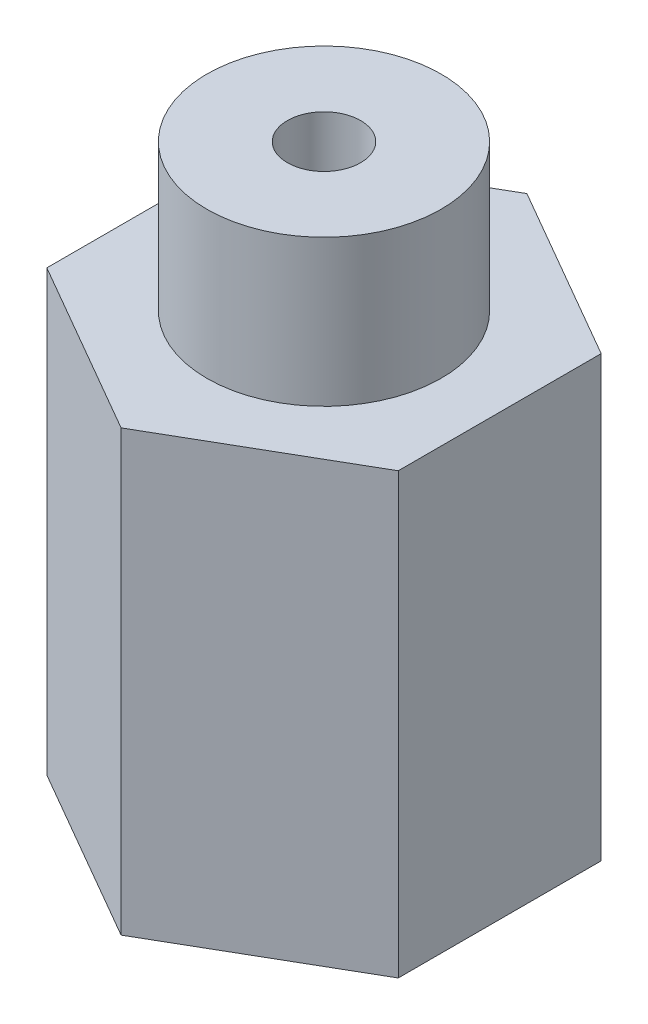
ISO-10303-21;
HEADER;
FILE_DESCRIPTION(('STEP AP214'),'2;1');
FILE_NAME('part.step','',(''),(''),'','','');
FILE_SCHEMA(('AUTOMOTIVE_DESIGN { 1 0 10303 214 1 1 1 1 }'));
ENDSEC;
DATA;
#1=APPLICATION_CONTEXT('core data for automotive mechanical design processes');
#2=APPLICATION_PROTOCOL_DEFINITION('international standard','automotive_design',2000,#1);
#3=PRODUCT_CONTEXT('',#1,'mechanical');
#4=PRODUCT('Part','Part','',(#3));
#5=PRODUCT_RELATED_PRODUCT_CATEGORY('part','',(#4));
#6=PRODUCT_DEFINITION_FORMATION('','',#4);
#7=PRODUCT_DEFINITION_CONTEXT('part definition',#1,'design');
#8=PRODUCT_DEFINITION('design','',#6,#7);
#9=PRODUCT_DEFINITION_SHAPE('','',#8);
#10=(LENGTH_UNIT() NAMED_UNIT(*) SI_UNIT(.MILLI.,.METRE.));
#11=(NAMED_UNIT(*) PLANE_ANGLE_UNIT() SI_UNIT($,.RADIAN.));
#12=(NAMED_UNIT(*) SI_UNIT($,.STERADIAN.) SOLID_ANGLE_UNIT());
#13=UNCERTAINTY_MEASURE_WITH_UNIT(LENGTH_MEASURE(1.E-05),#10,'distance_accuracy_value','');
#14=(GEOMETRIC_REPRESENTATION_CONTEXT(3) GLOBAL_UNCERTAINTY_ASSIGNED_CONTEXT((#13)) GLOBAL_UNIT_ASSIGNED_CONTEXT((#10,
#11,#12)) REPRESENTATION_CONTEXT('',''));
#15=CARTESIAN_POINT('',(0.,0.,0.));
#16=DIRECTION('',(0.,0.,1.));
#17=DIRECTION('',(1.,0.,0.));
#18=AXIS2_PLACEMENT_3D('',#15,#16,#17);
#19=CARTESIAN_POINT('',(0.,40.,0.));
#20=DIRECTION('',(0.,1.,0.));
#21=DIRECTION('',(0.,0.,1.));
#22=AXIS2_PLACEMENT_3D('',#19,#20,#21);
#23=PLANE('',#22);
#24=CARTESIAN_POINT('',(0.,40.,0.));
#25=DIRECTION('',(0.,1.,0.));
#26=DIRECTION('',(0.,0.,1.));
#27=AXIS2_PLACEMENT_3D('',#24,#25,#26);
#28=CIRCLE('',#27,2.5);
#29=CARTESIAN_POINT('',(0.,40.,2.5));
#30=VERTEX_POINT('',#29);
#31=EDGE_CURVE('E93',#30,#30,#28,.T.);
#32=ORIENTED_EDGE('',*,*,#31,.F.);
#33=EDGE_LOOP('',(#32));
#34=FACE_BOUND('',#33,.T.);
#35=CARTESIAN_POINT('',(0.,40.,0.));
#36=DIRECTION('',(0.,1.,0.));
#37=DIRECTION('',(0.,0.,1.));
#38=AXIS2_PLACEMENT_3D('',#35,#36,#37);
#39=CIRCLE('',#38,8.);
#40=CARTESIAN_POINT('',(0.,40.,8.));
#41=VERTEX_POINT('',#40);
#42=EDGE_CURVE('E153',#41,#41,#39,.T.);
#43=ORIENTED_EDGE('',*,*,#42,.T.);
#44=EDGE_LOOP('',(#43));
#45=FACE_BOUND('',#44,.T.);
#46=ADVANCED_FACE('F36',(#34,#45),#23,.T.);
#47=CARTESIAN_POINT('',(0.,5.,0.));
#48=DIRECTION('',(0.,1.,0.));
#49=DIRECTION('',(0.,0.,1.));
#50=AXIS2_PLACEMENT_3D('',#47,#48,#49);
#51=CYLINDRICAL_SURFACE('',#50,2.5);
#52=CARTESIAN_POINT('',(0.,12.8412291827593,2.5));
#53=CARTESIAN_POINT('',(-0.144806938883152,12.8088457079028,2.49999613350365));
#54=CARTESIAN_POINT('',(-0.289028883440481,12.7729934533241,2.487385699323));
#55=CARTESIAN_POINT('',(-0.572685541726236,12.698185111059,2.43779944329071));
#56=CARTESIAN_POINT('',(-0.712104950718499,12.6592202163746,2.40075216654977));
#57=CARTESIAN_POINT('',(-0.982737108641274,12.5824978096844,2.30323660971659));
#58=CARTESIAN_POINT('',(-1.11395646062066,12.5447393385073,2.24278746361677));
#59=CARTESIAN_POINT('',(-1.36515702059755,12.4749378324765,2.0993314282989));
#60=CARTESIAN_POINT('',(-1.48514899693424,12.4428892939005,2.01634645798351));
#61=CARTESIAN_POINT('',(-1.65248462688832,12.4028393660326,1.87734127549326));
#62=CARTESIAN_POINT('',(-1.70560076455449,12.3909216336532,1.82923245860952));
#63=CARTESIAN_POINT('',(-1.80777491498942,12.3699928871066,1.72832166513312));
#64=CARTESIAN_POINT('',(-1.85683508421282,12.3609803208508,1.67552221381606));
#65=CARTESIAN_POINT('',(-1.95037425025297,12.3462580726977,1.56564379379326));
#66=CARTESIAN_POINT('',(-1.9948566448594,12.340545926364,1.50856805427905));
#67=CARTESIAN_POINT('',(-2.07879491602665,12.3326676502262,1.39063234552099));
#68=CARTESIAN_POINT('',(-2.11825148234932,12.330501033337,1.32977289727603));
#69=CARTESIAN_POINT('',(-2.21913720812233,12.3296009054966,1.1581855526258));
#70=CARTESIAN_POINT('',(-2.27502992472085,12.3346287869363,1.04409154299364));
#71=CARTESIAN_POINT('',(-2.36863342453234,12.3552090428959,0.809658903020393));
#72=CARTESIAN_POINT('',(-2.40634027855286,12.3707636900598,0.689318929406996));
#73=CARTESIAN_POINT('',(-2.46263049805831,12.4099858385252,0.447838959886879));
#74=CARTESIAN_POINT('',(-2.48153270160555,12.4335086782096,0.326748622504449));
#75=CARTESIAN_POINT('',(-2.50153897741223,12.4861574798729,0.0843434048425648));
#76=CARTESIAN_POINT('',(-2.50263663414964,12.515285457729,-0.0369715406233163));
#77=CARTESIAN_POINT('',(-2.48654000602638,12.5801061892708,-0.29215360418211));
#78=CARTESIAN_POINT('',(-2.4671457776716,12.6161675132516,-0.425789732349401));
#79=CARTESIAN_POINT('',(-2.40716018198094,12.6883122748318,-0.68827553888499));
#80=CARTESIAN_POINT('',(-2.36655563211677,12.7243957122285,-0.817122187114067));
#81=CARTESIAN_POINT('',(-2.26074834749269,12.7958459784118,-1.07712299376777));
#82=CARTESIAN_POINT('',(-2.19388515881863,12.8309412410608,-1.20768405047198));
#83=CARTESIAN_POINT('',(-2.03727608338538,12.8932849262091,-1.4563870032701));
#84=CARTESIAN_POINT('',(-1.94754298283769,12.9205377152455,-1.57453578691805));
#85=CARTESIAN_POINT('',(-1.75344719000644,12.9626285002177,-1.78742128901788));
#86=CARTESIAN_POINT('',(-1.65031907452676,12.9781253255665,-1.88314940724886));
#87=CARTESIAN_POINT('',(-1.4287692320465,12.9975653480724,-2.05629411246321));
#88=CARTESIAN_POINT('',(-1.31035790979386,13.0015163627027,-2.1337230568447));
#89=CARTESIAN_POINT('',(-1.07384360270563,12.9976111014874,-2.26124533262727));
#90=CARTESIAN_POINT('',(-0.956719929954795,12.9908104600176,-2.31320149064648));
#91=CARTESIAN_POINT('',(-0.716735511044833,12.9680117698988,-2.39843802096107));
#92=CARTESIAN_POINT('',(-0.593874534048498,12.9520133508889,-2.43171764111397));
#93=CARTESIAN_POINT('',(-0.34540271582137,12.9122483895119,-2.47926581234357));
#94=CARTESIAN_POINT('',(-0.219784480183485,12.8884577245289,-2.49347462014847));
#95=CARTESIAN_POINT('',(0.0309382040052335,12.8351894027199,-2.50295781645118));
#96=CARTESIAN_POINT('',(0.156042476645091,12.8057099415211,-2.49822618799382));
#97=CARTESIAN_POINT('',(0.41456776793743,12.7406287085655,-2.46912033832177));
#98=CARTESIAN_POINT('',(0.547713911031709,12.7047141538277,-2.44300341242219));
#99=CARTESIAN_POINT('',(0.808002476033582,12.6323359361211,-2.36969158169483));
#100=CARTESIAN_POINT('',(0.935140106746234,12.5958718645332,-2.32248015952735));
#101=CARTESIAN_POINT('',(1.18980467106121,12.5235203515442,-2.2035230737855));
#102=CARTESIAN_POINT('',(1.31668970945532,12.4878669820241,-2.13024501871407));
#103=CARTESIAN_POINT('',(1.55702412017252,12.4249275275171,-1.96142565412147));
#104=CARTESIAN_POINT('',(1.6704846433415,12.3976344678068,-1.86590302026722));
#105=CARTESIAN_POINT('',(1.87292486191385,12.3571843287352,-1.66175160197432));
#106=CARTESIAN_POINT('',(1.96302599852904,12.3432132290477,-1.55440375941335));
#107=CARTESIAN_POINT('',(2.12425840093792,12.3287484992071,-1.32554525234363));
#108=CARTESIAN_POINT('',(2.19540665390722,12.3282427597505,-1.20404741161247));
#109=CARTESIAN_POINT('',(2.30902297762029,12.3400108224817,-0.96629167739918));
#110=CARTESIAN_POINT('',(2.3538718499843,12.3507972157821,-0.851082293010982));
#111=CARTESIAN_POINT('',(2.42591647997904,12.3814488189471,-0.61644062835946));
#112=CARTESIAN_POINT('',(2.45310657494128,12.4013169375866,-0.497007006436417));
#113=CARTESIAN_POINT('',(2.49030265878003,12.4485353153881,-0.253139398219101));
#114=CARTESIAN_POINT('',(2.49975915355705,12.4760953258956,-0.128664014282491));
#115=CARTESIAN_POINT('',(2.50023204447395,12.5355313862354,0.119281362199309));
#116=CARTESIAN_POINT('',(2.49123976378303,12.5674094603543,0.242750854233563));
#117=CARTESIAN_POINT('',(2.45298358849071,12.6367728319349,0.50216474364475));
#118=CARTESIAN_POINT('',(2.42129079432893,12.674456162635,0.637702601272505));
#119=CARTESIAN_POINT('',(2.33567006301585,12.7478339582885,0.902207593068415));
#120=CARTESIAN_POINT('',(2.28173224854874,12.7835275317403,1.03117177975333));
#121=CARTESIAN_POINT('',(2.14971813491847,12.8506853072205,1.28448752964668));
#122=CARTESIAN_POINT('',(2.07075460162749,12.8819203582318,1.4084421960658));
#123=CARTESIAN_POINT('',(1.89108727557517,12.9347675120544,1.64177238995498));
#124=CARTESIAN_POINT('',(1.79040295199714,12.9563881798232,1.7511608326057));
#125=CARTESIAN_POINT('',(1.57964745521846,12.9860231878102,1.94247184507599));
#126=CARTESIAN_POINT('',(1.47112880092008,12.9950479836358,2.02594763364057));
#127=CARTESIAN_POINT('',(1.24162114662461,13.0018452165709,2.17416995106217));
#128=CARTESIAN_POINT('',(1.12063303041888,12.9996184506148,2.2389178060524));
#129=CARTESIAN_POINT('',(0.879600062744846,12.9847504854365,2.34356658754543));
#130=CARTESIAN_POINT('',(0.760140927880985,12.9728876935382,2.38494528720193));
#131=CARTESIAN_POINT('',(0.517547869412498,12.9408716635307,2.4490501012454));
#132=CARTESIAN_POINT('',(0.394419532183329,12.9207304855228,2.47180320607666));
#133=CARTESIAN_POINT('',(0.225873389662423,12.8888036676883,2.49019175587237));
#134=CARTESIAN_POINT('',(0.180665502049314,12.8798134643767,2.49387435413275));
#135=CARTESIAN_POINT('',(0.0902861532480202,12.8610706706702,2.49877876831171));
#136=CARTESIAN_POINT('',(0.0451146857485094,12.8513182731224,2.50000120460918));
#137=CARTESIAN_POINT('',(0.,12.8412291827593,2.5));
#138=B_SPLINE_CURVE_WITH_KNOTS('',3,(#52,#53,#54,#55,#56,#57,#58,#59,#60,#61,#62,#63,#64,#65,
#66,#67,#68,#69,#70,#71,#72,#73,#74,#75,#76,#77,#78,#79,#80,#81,#82,#83,#84,#85,#86,#87,#88,#89,
#90,#91,#92,#93,#94,#95,#96,#97,#98,#99,#100,#101,#102,#103,#104,#105,#106,#107,#108,#109,#110,
#111,#112,#113,#114,#115,#116,#117,#118,#119,#120,#121,#122,#123,#124,#125,#126,#127,#128,#129,
#130,#131,#132,#133,#134,#135,#136,#137),.UNSPECIFIED.,.T.,.F.,(4,2,2,2,2,2,2,2,2,2,2,2,2,2,2,2,
2,2,2,2,2,2,2,2,2,2,2,2,2,2,2,2,2,2,2,2,2,2,2,2,2,2,4),(0.,0.444975914292034,0.891258769060138,
1.33717749910608,1.78266406133248,2.00034328396524,2.21790601769504,2.43530608583018,
2.65267628501481,3.03202650097517,3.41145864172782,3.78434178780691,4.15735929208904,
4.57491985267351,4.99274024264245,5.44289551637526,5.89279966528707,6.31511427014656,
6.73714286659838,7.1202379836701,7.5033485276609,7.88765646522061,8.27208649854865,
8.69138528173445,9.1110129597432,9.56110669063471,10.0108238944039,10.4308625723739,
10.8505234997515,11.2211130814953,11.5918214421955,11.9738380856328,12.3560344403819,
12.786757856741,13.2176727307567,13.665998188453,14.1139234521039,14.5233172714741,
14.9326820943869,15.3119236594783,15.690614685952,15.8292821621384,15.9679146661729),.UNSPECIFIED.);
#139=CARTESIAN_POINT('',(0.,12.8412291827593,2.5));
#140=VERTEX_POINT('',#139);
#141=EDGE_CURVE('E156',#140,#140,#138,.T.);
#142=ORIENTED_EDGE('',*,*,#141,.T.);
#143=EDGE_LOOP('',(#142));
#144=FACE_BOUND('',#143,.T.);
#145=ORIENTED_EDGE('',*,*,#31,.T.);
#146=EDGE_LOOP('',(#145));
#147=FACE_BOUND('',#146,.T.);
#148=ADVANCED_FACE('F168',(#144,#147),#51,.F.);
#149=CARTESIAN_POINT('',(0.,30.,0.));
#150=DIRECTION('',(0.,1.,0.));
#151=DIRECTION('',(0.,0.,1.));
#152=AXIS2_PLACEMENT_3D('',#149,#150,#151);
#153=PLANE('',#152);
#154=CARTESIAN_POINT('',(0.,30.,0.));
#155=DIRECTION('',(0.,1.,0.));
#156=DIRECTION('',(0.,0.,1.));
#157=AXIS2_PLACEMENT_3D('',#154,#155,#156);
#158=CIRCLE('',#157,8.);
#159=CARTESIAN_POINT('',(0.,30.,8.));
#160=VERTEX_POINT('',#159);
#161=EDGE_CURVE('E152',#160,#160,#158,.T.);
#162=ORIENTED_EDGE('',*,*,#161,.F.);
#163=EDGE_LOOP('',(#162));
#164=FACE_BOUND('',#163,.T.);
#165=DIRECTION('',(-0.866025403784439,0.,-0.5));
#166=VECTOR('',#165,1.);
#167=CARTESIAN_POINT('',(12.,30.,-6.92820323027552));
#168=LINE('',#167,#166);
#169=CARTESIAN_POINT('',(12.,30.,-6.92820323027552));
#170=VERTEX_POINT('',#169);
#171=CARTESIAN_POINT('',(0.,30.,-13.856406460551));
#172=VERTEX_POINT('',#171);
#173=EDGE_CURVE('E88',#170,#172,#168,.T.);
#174=ORIENTED_EDGE('',*,*,#173,.T.);
#175=DIRECTION('',(-0.866025403784439,0.,0.5));
#176=VECTOR('',#175,1.);
#177=CARTESIAN_POINT('',(0.,30.,-13.856406460551));
#178=LINE('',#177,#176);
#179=CARTESIAN_POINT('',(-12.,30.,-6.92820323027551));
#180=VERTEX_POINT('',#179);
#181=EDGE_CURVE('E94',#172,#180,#178,.T.);
#182=ORIENTED_EDGE('',*,*,#181,.T.);
#183=DIRECTION('',(0.,0.,1.));
#184=VECTOR('',#183,1.);
#185=CARTESIAN_POINT('',(-12.,30.,-6.92820323027551));
#186=LINE('',#185,#184);
#187=CARTESIAN_POINT('',(-12.,30.,6.92820323027551));
#188=VERTEX_POINT('',#187);
#189=EDGE_CURVE('E146',#180,#188,#186,.T.);
#190=ORIENTED_EDGE('',*,*,#189,.T.);
#191=DIRECTION('',(0.866025403784439,0.,0.5));
#192=VECTOR('',#191,1.);
#193=CARTESIAN_POINT('',(-12.,30.,6.92820323027551));
#194=LINE('',#193,#192);
#195=CARTESIAN_POINT('',(0.,30.,13.856406460551));
#196=VERTEX_POINT('',#195);
#197=EDGE_CURVE('E142',#188,#196,#194,.T.);
#198=ORIENTED_EDGE('',*,*,#197,.T.);
#199=DIRECTION('',(0.866025403784439,0.,-0.5));
#200=VECTOR('',#199,1.);
#201=CARTESIAN_POINT('',(0.,30.,13.856406460551));
#202=LINE('',#201,#200);
#203=CARTESIAN_POINT('',(12.,30.,6.92820323027551));
#204=VERTEX_POINT('',#203);
#205=EDGE_CURVE('E50',#196,#204,#202,.T.);
#206=ORIENTED_EDGE('',*,*,#205,.T.);
#207=DIRECTION('',(0.,0.,-1.));
#208=VECTOR('',#207,1.);
#209=CARTESIAN_POINT('',(12.,30.,6.92820323027551));
#210=LINE('',#209,#208);
#211=EDGE_CURVE('E12',#204,#170,#210,.T.);
#212=ORIENTED_EDGE('',*,*,#211,.T.);
#213=EDGE_LOOP('',(#174,#182,#190,#198,#206,#212));
#214=FACE_BOUND('',#213,.T.);
#215=ADVANCED_FACE('F87',(#164,#214),#153,.T.);
#216=CARTESIAN_POINT('',(0.,30.,0.));
#217=DIRECTION('',(0.,1.,0.));
#218=DIRECTION('',(0.,0.,1.));
#219=AXIS2_PLACEMENT_3D('',#216,#217,#218);
#220=CYLINDRICAL_SURFACE('',#219,8.);
#221=ORIENTED_EDGE('',*,*,#161,.T.);
#222=EDGE_LOOP('',(#221));
#223=FACE_BOUND('',#222,.T.);
#224=ORIENTED_EDGE('',*,*,#42,.F.);
#225=EDGE_LOOP('',(#224));
#226=FACE_BOUND('',#225,.T.);
#227=ADVANCED_FACE('F179',(#223,#226),#220,.T.);
#228=CARTESIAN_POINT('',(0.,0.,0.));
#229=DIRECTION('',(0.,1.,0.));
#230=DIRECTION('',(0.,0.,1.));
#231=AXIS2_PLACEMENT_3D('',#228,#229,#230);
#232=PLANE('',#231);
#233=DIRECTION('',(-0.866025403784439,0.,-0.5));
#234=VECTOR('',#233,1.);
#235=CARTESIAN_POINT('',(12.,0.,-6.92820323027552));
#236=LINE('',#235,#234);
#237=CARTESIAN_POINT('',(12.,0.,-6.92820323027552));
#238=VERTEX_POINT('',#237);
#239=CARTESIAN_POINT('',(0.,0.,-13.856406460551));
#240=VERTEX_POINT('',#239);
#241=EDGE_CURVE('E121',#238,#240,#236,.T.);
#242=ORIENTED_EDGE('',*,*,#241,.F.);
#243=DIRECTION('',(0.,0.,-1.));
#244=VECTOR('',#243,1.);
#245=CARTESIAN_POINT('',(12.,0.,6.92820323027551));
#246=LINE('',#245,#244);
#247=CARTESIAN_POINT('',(12.,0.,6.92820323027551));
#248=VERTEX_POINT('',#247);
#249=EDGE_CURVE('E98',#248,#238,#246,.T.);
#250=ORIENTED_EDGE('',*,*,#249,.F.);
#251=DIRECTION('',(0.866025403784439,0.,-0.5));
#252=VECTOR('',#251,1.);
#253=CARTESIAN_POINT('',(0.,0.,13.856406460551));
#254=LINE('',#253,#252);
#255=CARTESIAN_POINT('',(0.,0.,13.856406460551));
#256=VERTEX_POINT('',#255);
#257=EDGE_CURVE('E104',#256,#248,#254,.T.);
#258=ORIENTED_EDGE('',*,*,#257,.F.);
#259=DIRECTION('',(0.866025403784439,0.,0.5));
#260=VECTOR('',#259,1.);
#261=CARTESIAN_POINT('',(-12.,0.,6.92820323027551));
#262=LINE('',#261,#260);
#263=CARTESIAN_POINT('',(-12.,0.,6.92820323027551));
#264=VERTEX_POINT('',#263);
#265=EDGE_CURVE('E131',#264,#256,#262,.T.);
#266=ORIENTED_EDGE('',*,*,#265,.F.);
#267=DIRECTION('',(0.,0.,1.));
#268=VECTOR('',#267,1.);
#269=CARTESIAN_POINT('',(-12.,0.,-6.92820323027551));
#270=LINE('',#269,#268);
#271=CARTESIAN_POINT('',(-12.,0.,-6.92820323027551));
#272=VERTEX_POINT('',#271);
#273=EDGE_CURVE('E124',#272,#264,#270,.T.);
#274=ORIENTED_EDGE('',*,*,#273,.F.);
#275=DIRECTION('',(-0.866025403784439,0.,0.5));
#276=VECTOR('',#275,1.);
#277=CARTESIAN_POINT('',(0.,0.,-13.856406460551));
#278=LINE('',#277,#276);
#279=EDGE_CURVE('E117',#240,#272,#278,.T.);
#280=ORIENTED_EDGE('',*,*,#279,.F.);
#281=EDGE_LOOP('',(#242,#250,#258,#266,#274,#280));
#282=FACE_BOUND('',#281,.T.);
#283=ADVANCED_FACE('F120',(#282),#232,.F.);
#284=CARTESIAN_POINT('',(12.,40.,6.92820323027551));
#285=DIRECTION('',(-1.,0.,0.));
#286=DIRECTION('',(0.,0.,1.));
#287=AXIS2_PLACEMENT_3D('',#284,#285,#286);
#288=PLANE('',#287);
#289=ORIENTED_EDGE('',*,*,#211,.F.);
#290=DIRECTION('',(0.,-1.,0.));
#291=VECTOR('',#290,1.);
#292=CARTESIAN_POINT('',(12.,40.,6.92820323027551));
#293=LINE('',#292,#291);
#294=EDGE_CURVE('E100',#204,#248,#293,.T.);
#295=ORIENTED_EDGE('',*,*,#294,.T.);
#296=ORIENTED_EDGE('',*,*,#249,.T.);
#297=DIRECTION('',(0.,-1.,0.));
#298=VECTOR('',#297,1.);
#299=CARTESIAN_POINT('',(12.,40.,-6.92820323027552));
#300=LINE('',#299,#298);
#301=EDGE_CURVE('E58',#170,#238,#300,.T.);
#302=ORIENTED_EDGE('',*,*,#301,.F.);
#303=EDGE_LOOP('',(#289,#295,#296,#302));
#304=FACE_BOUND('',#303,.T.);
#305=ADVANCED_FACE('F96',(#304),#288,.F.);
#306=CARTESIAN_POINT('',(0.,40.,13.856406460551));
#307=DIRECTION('',(-0.5,0.,-0.866025403784439));
#308=DIRECTION('',(-0.866025403784439,0.,0.5));
#309=AXIS2_PLACEMENT_3D('',#306,#307,#308);
#310=PLANE('',#309);
#311=ORIENTED_EDGE('',*,*,#205,.F.);
#312=DIRECTION('',(0.,-1.,0.));
#313=VECTOR('',#312,1.);
#314=CARTESIAN_POINT('',(0.,40.,13.856406460551));
#315=LINE('',#314,#313);
#316=EDGE_CURVE('E102',#196,#256,#315,.T.);
#317=ORIENTED_EDGE('',*,*,#316,.T.);
#318=ORIENTED_EDGE('',*,*,#257,.T.);
#319=ORIENTED_EDGE('',*,*,#294,.F.);
#320=EDGE_LOOP('',(#311,#317,#318,#319));
#321=FACE_BOUND('',#320,.T.);
#322=ADVANCED_FACE('F136',(#321),#310,.F.);
#323=CARTESIAN_POINT('',(-12.,40.,6.92820323027551));
#324=DIRECTION('',(0.5,0.,-0.866025403784439));
#325=DIRECTION('',(-0.866025403784439,0.,-0.5));
#326=AXIS2_PLACEMENT_3D('',#323,#324,#325);
#327=PLANE('',#326);
#328=ORIENTED_EDGE('',*,*,#197,.F.);
#329=DIRECTION('',(0.,-1.,0.));
#330=VECTOR('',#329,1.);
#331=CARTESIAN_POINT('',(-12.,40.,6.92820323027551));
#332=LINE('',#331,#330);
#333=EDGE_CURVE('E109',#188,#264,#332,.T.);
#334=ORIENTED_EDGE('',*,*,#333,.T.);
#335=ORIENTED_EDGE('',*,*,#265,.T.);
#336=ORIENTED_EDGE('',*,*,#316,.F.);
#337=EDGE_LOOP('',(#328,#334,#335,#336));
#338=FACE_BOUND('',#337,.T.);
#339=ADVANCED_FACE('F140',(#338),#327,.F.);
#340=CARTESIAN_POINT('',(-12.,40.,-6.92820323027551));
#341=DIRECTION('',(1.,0.,0.));
#342=DIRECTION('',(0.,0.,-1.));
#343=AXIS2_PLACEMENT_3D('',#340,#341,#342);
#344=PLANE('',#343);
#345=ORIENTED_EDGE('',*,*,#189,.F.);
#346=DIRECTION('',(0.,-1.,0.));
#347=VECTOR('',#346,1.);
#348=CARTESIAN_POINT('',(-12.,40.,-6.92820323027551));
#349=LINE('',#348,#347);
#350=EDGE_CURVE('E111',#180,#272,#349,.T.);
#351=ORIENTED_EDGE('',*,*,#350,.T.);
#352=ORIENTED_EDGE('',*,*,#273,.T.);
#353=ORIENTED_EDGE('',*,*,#333,.F.);
#354=EDGE_LOOP('',(#345,#351,#352,#353));
#355=FACE_BOUND('',#354,.T.);
#356=ADVANCED_FACE('F145',(#355),#344,.F.);
#357=CARTESIAN_POINT('',(0.,40.,-13.856406460551));
#358=DIRECTION('',(0.5,0.,0.866025403784438));
#359=DIRECTION('',(0.866025403784439,0.,-0.5));
#360=AXIS2_PLACEMENT_3D('',#357,#358,#359);
#361=PLANE('',#360);
#362=CARTESIAN_POINT('',(-6.,8.,-10.3923048454133));
#363=DIRECTION('',(-0.5,0.,-0.866025403784438));
#364=DIRECTION('',(-0.866025403784439,0.,0.5));
#365=AXIS2_PLACEMENT_3D('',#362,#363,#364);
#366=CIRCLE('',#365,5.);
#367=CARTESIAN_POINT('',(-10.3301270189222,8.,-7.89230484541326));
#368=VERTEX_POINT('',#367);
#369=EDGE_CURVE('E166',#368,#368,#366,.T.);
#370=ORIENTED_EDGE('',*,*,#369,.F.);
#371=EDGE_LOOP('',(#370));
#372=FACE_BOUND('',#371,.T.);
#373=ORIENTED_EDGE('',*,*,#181,.F.);
#374=DIRECTION('',(0.,-1.,0.));
#375=VECTOR('',#374,1.);
#376=CARTESIAN_POINT('',(0.,40.,-13.856406460551));
#377=LINE('',#376,#375);
#378=EDGE_CURVE('E44',#172,#240,#377,.T.);
#379=ORIENTED_EDGE('',*,*,#378,.T.);
#380=ORIENTED_EDGE('',*,*,#279,.T.);
#381=ORIENTED_EDGE('',*,*,#350,.F.);
#382=EDGE_LOOP('',(#373,#379,#380,#381));
#383=FACE_BOUND('',#382,.T.);
#384=ADVANCED_FACE('F115',(#372,#383),#361,.F.);
#385=CARTESIAN_POINT('',(12.,40.,-6.92820323027552));
#386=DIRECTION('',(-0.5,0.,0.866025403784439));
#387=DIRECTION('',(0.866025403784439,0.,0.5));
#388=AXIS2_PLACEMENT_3D('',#385,#386,#387);
#389=PLANE('',#388);
#390=ORIENTED_EDGE('',*,*,#173,.F.);
#391=ORIENTED_EDGE('',*,*,#301,.T.);
#392=ORIENTED_EDGE('',*,*,#241,.T.);
#393=ORIENTED_EDGE('',*,*,#378,.F.);
#394=EDGE_LOOP('',(#390,#391,#392,#393));
#395=FACE_BOUND('',#394,.T.);
#396=ADVANCED_FACE('F38',(#395),#389,.F.);
#397=CARTESIAN_POINT('',(1.5,8.,2.59807621135331));
#398=DIRECTION('',(-0.5,0.,-0.866025403784438));
#399=DIRECTION('',(-0.866025403784439,0.,0.5));
#400=AXIS2_PLACEMENT_3D('',#397,#398,#399);
#401=CYLINDRICAL_SURFACE('',#400,5.);
#402=ORIENTED_EDGE('',*,*,#369,.T.);
#403=EDGE_LOOP('',(#402));
#404=FACE_BOUND('',#403,.T.);
#405=CARTESIAN_POINT('',(1.5,8.,2.59807621135331));
#406=DIRECTION('',(-0.5,0.,-0.866025403784438));
#407=DIRECTION('',(-0.866025403784439,0.,0.5));
#408=AXIS2_PLACEMENT_3D('',#405,#406,#407);
#409=CIRCLE('',#408,5.);
#410=CARTESIAN_POINT('',(-2.8301270189222,8.,5.09807621135331));
#411=VERTEX_POINT('',#410);
#412=EDGE_CURVE('E165',#411,#411,#409,.T.);
#413=ORIENTED_EDGE('',*,*,#412,.F.);
#414=EDGE_LOOP('',(#413));
#415=FACE_BOUND('',#414,.T.);
#416=ORIENTED_EDGE('',*,*,#141,.F.);
#417=EDGE_LOOP('',(#416));
#418=FACE_BOUND('',#417,.T.);
#419=ADVANCED_FACE('F172',(#404,#415,#418),#401,.F.);
#420=CARTESIAN_POINT('',(1.5,8.,2.59807621135331));
#421=DIRECTION('',(-0.5,0.,-0.866025403784438));
#422=DIRECTION('',(-0.866025403784439,0.,0.5));
#423=AXIS2_PLACEMENT_3D('',#420,#421,#422);
#424=PLANE('',#423);
#425=ORIENTED_EDGE('',*,*,#412,.T.);
#426=EDGE_LOOP('',(#425));
#427=FACE_BOUND('',#426,.T.);
#428=ADVANCED_FACE('F177',(#427),#424,.T.);
#429=CLOSED_SHELL('',(#46,#148,#215,#227,#283,#305,#322,#339,#356,#384,#396,#419,#428));
#430=MANIFOLD_SOLID_BREP('B2',#429);
#431=ADVANCED_BREP_SHAPE_REPRESENTATION('',(#18,#430),#14);
#432=SHAPE_DEFINITION_REPRESENTATION(#9,#431);
ENDSEC;
END-ISO-10303-21;
